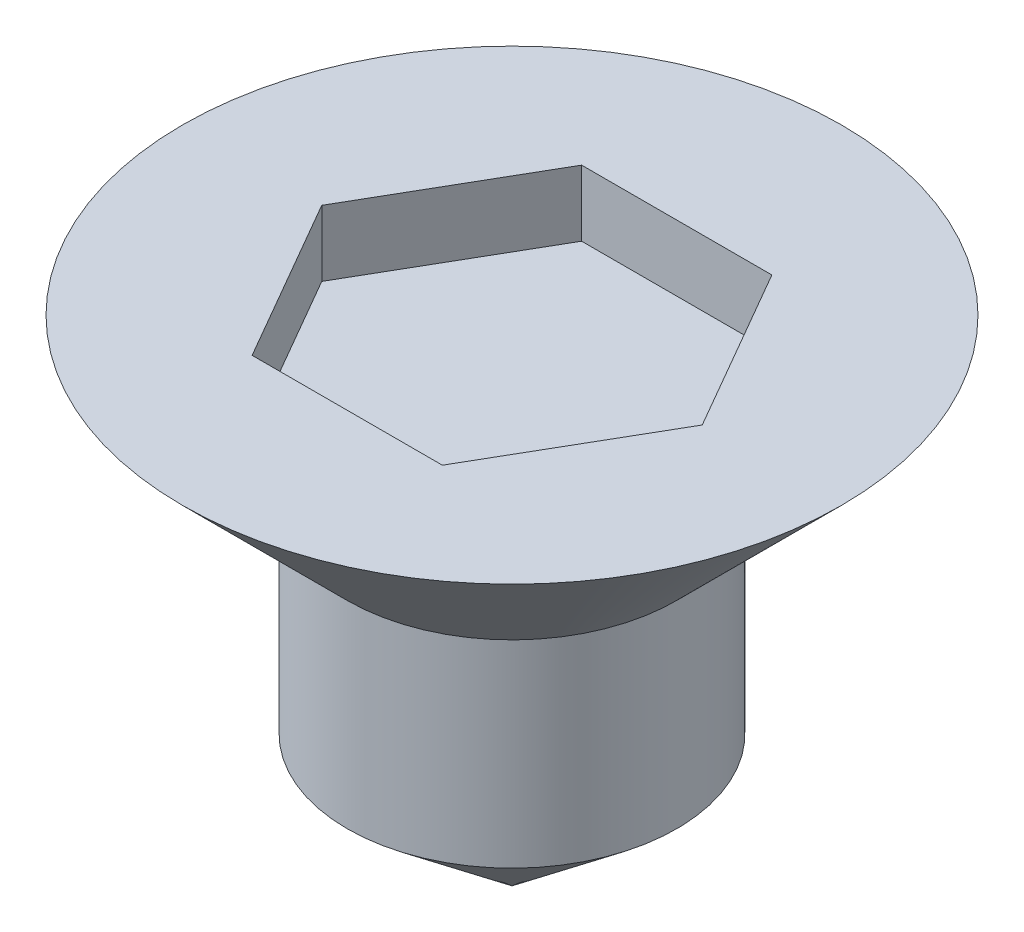
ISO-10303-21;
HEADER;
FILE_DESCRIPTION(('STEP AP214'),'2;1');
FILE_NAME('part.step','',(''),(''),'','','');
FILE_SCHEMA(('AUTOMOTIVE_DESIGN { 1 0 10303 214 1 1 1 1 }'));
ENDSEC;
DATA;
#1=APPLICATION_CONTEXT('core data for automotive mechanical design processes');
#2=APPLICATION_PROTOCOL_DEFINITION('international standard','automotive_design',2000,#1);
#3=PRODUCT_CONTEXT('',#1,'mechanical');
#4=PRODUCT('Part','Part','',(#3));
#5=PRODUCT_RELATED_PRODUCT_CATEGORY('part','',(#4));
#6=PRODUCT_DEFINITION_FORMATION('','',#4);
#7=PRODUCT_DEFINITION_CONTEXT('part definition',#1,'design');
#8=PRODUCT_DEFINITION('design','',#6,#7);
#9=PRODUCT_DEFINITION_SHAPE('','',#8);
#10=(LENGTH_UNIT() NAMED_UNIT(*) SI_UNIT(.MILLI.,.METRE.));
#11=(NAMED_UNIT(*) PLANE_ANGLE_UNIT() SI_UNIT($,.RADIAN.));
#12=(NAMED_UNIT(*) SI_UNIT($,.STERADIAN.) SOLID_ANGLE_UNIT());
#13=UNCERTAINTY_MEASURE_WITH_UNIT(LENGTH_MEASURE(1.E-05),#10,'distance_accuracy_value','');
#14=(GEOMETRIC_REPRESENTATION_CONTEXT(3) GLOBAL_UNCERTAINTY_ASSIGNED_CONTEXT((#13)) GLOBAL_UNIT_ASSIGNED_CONTEXT((#10,
#11,#12)) REPRESENTATION_CONTEXT('',''));
#15=CARTESIAN_POINT('',(0.,0.,0.));
#16=DIRECTION('',(0.,0.,1.));
#17=DIRECTION('',(1.,0.,0.));
#18=AXIS2_PLACEMENT_3D('',#15,#16,#17);
#19=CARTESIAN_POINT('',(0.,1.5,0.));
#20=DIRECTION('',(0.,-1.,0.));
#21=DIRECTION('',(0.,0.,-1.));
#22=AXIS2_PLACEMENT_3D('',#19,#20,#21);
#23=CYLINDRICAL_SURFACE('',#22,1.25);
#24=CARTESIAN_POINT('',(0.,1.5,0.));
#25=DIRECTION('',(0.,1.,0.));
#26=DIRECTION('',(0.,0.,1.));
#27=AXIS2_PLACEMENT_3D('',#24,#25,#26);
#28=CIRCLE('',#27,1.25);
#29=CARTESIAN_POINT('',(0.,1.5,1.25));
#30=VERTEX_POINT('',#29);
#31=EDGE_CURVE('E11',#30,#30,#28,.T.);
#32=ORIENTED_EDGE('',*,*,#31,.F.);
#33=EDGE_LOOP('',(#32));
#34=FACE_BOUND('',#33,.T.);
#35=CARTESIAN_POINT('',(0.,0.,0.));
#36=DIRECTION('',(0.,1.,0.));
#37=DIRECTION('',(0.,0.,1.));
#38=AXIS2_PLACEMENT_3D('',#35,#36,#37);
#39=CIRCLE('',#38,1.25);
#40=CARTESIAN_POINT('',(0.,0.,1.25));
#41=VERTEX_POINT('',#40);
#42=EDGE_CURVE('E145',#41,#41,#39,.T.);
#43=ORIENTED_EDGE('',*,*,#42,.T.);
#44=EDGE_LOOP('',(#43));
#45=FACE_BOUND('',#44,.T.);
#46=ADVANCED_FACE('F47',(#34,#45),#23,.T.);
#47=CARTESIAN_POINT('',(0.,2.75,0.));
#48=DIRECTION('',(0.,-1.,0.));
#49=DIRECTION('',(0.,0.,-1.));
#50=AXIS2_PLACEMENT_3D('',#47,#48,#49);
#51=PLANE('',#50);
#52=DIRECTION('',(-0.5,0.,-0.866025403784439));
#53=VECTOR('',#52,1.);
#54=CARTESIAN_POINT('',(1.44337567297406,2.75,0.));
#55=LINE('',#54,#53);
#56=CARTESIAN_POINT('',(1.44337567297406,2.75,0.));
#57=VERTEX_POINT('',#56);
#58=CARTESIAN_POINT('',(0.721687836487032,2.75,-1.25));
#59=VERTEX_POINT('',#58);
#60=EDGE_CURVE('E144',#57,#59,#55,.T.);
#61=ORIENTED_EDGE('',*,*,#60,.F.);
#62=DIRECTION('',(0.5,0.,-0.866025403784439));
#63=VECTOR('',#62,1.);
#64=CARTESIAN_POINT('',(0.721687836487032,2.75,1.25));
#65=LINE('',#64,#63);
#66=CARTESIAN_POINT('',(0.721687836487032,2.75,1.25));
#67=VERTEX_POINT('',#66);
#68=EDGE_CURVE('E62',#67,#57,#65,.T.);
#69=ORIENTED_EDGE('',*,*,#68,.F.);
#70=DIRECTION('',(1.,0.,0.));
#71=VECTOR('',#70,1.);
#72=CARTESIAN_POINT('',(-0.721687836487033,2.75,1.25));
#73=LINE('',#72,#71);
#74=CARTESIAN_POINT('',(-0.721687836487033,2.75,1.25));
#75=VERTEX_POINT('',#74);
#76=EDGE_CURVE('E158',#75,#67,#73,.T.);
#77=ORIENTED_EDGE('',*,*,#76,.F.);
#78=DIRECTION('',(0.5,0.,0.866025403784439));
#79=VECTOR('',#78,1.);
#80=CARTESIAN_POINT('',(-1.44337567297407,2.75,0.));
#81=LINE('',#80,#79);
#82=CARTESIAN_POINT('',(-1.44337567297407,2.75,0.));
#83=VERTEX_POINT('',#82);
#84=EDGE_CURVE('E155',#83,#75,#81,.T.);
#85=ORIENTED_EDGE('',*,*,#84,.F.);
#86=DIRECTION('',(-0.5,0.,0.866025403784439));
#87=VECTOR('',#86,1.);
#88=CARTESIAN_POINT('',(-0.721687836487032,2.75,-1.25));
#89=LINE('',#88,#87);
#90=CARTESIAN_POINT('',(-0.721687836487032,2.75,-1.25));
#91=VERTEX_POINT('',#90);
#92=EDGE_CURVE('E112',#91,#83,#89,.T.);
#93=ORIENTED_EDGE('',*,*,#92,.F.);
#94=DIRECTION('',(-1.,0.,0.));
#95=VECTOR('',#94,1.);
#96=CARTESIAN_POINT('',(0.721687836487032,2.75,-1.25));
#97=LINE('',#96,#95);
#98=EDGE_CURVE('E149',#59,#91,#97,.T.);
#99=ORIENTED_EDGE('',*,*,#98,.F.);
#100=EDGE_LOOP('',(#61,#69,#77,#85,#93,#99));
#101=FACE_BOUND('',#100,.T.);
#102=CARTESIAN_POINT('',(0.,2.75,0.));
#103=DIRECTION('',(0.,1.,0.));
#104=DIRECTION('',(0.,0.,1.));
#105=AXIS2_PLACEMENT_3D('',#102,#103,#104);
#106=CIRCLE('',#105,2.5);
#107=CARTESIAN_POINT('',(0.,2.75,2.5));
#108=VERTEX_POINT('',#107);
#109=EDGE_CURVE('E55',#108,#108,#106,.T.);
#110=ORIENTED_EDGE('',*,*,#109,.T.);
#111=EDGE_LOOP('',(#110));
#112=FACE_BOUND('',#111,.T.);
#113=ADVANCED_FACE('F176',(#101,#112),#51,.F.);
#114=CARTESIAN_POINT('',(0.,1.5,0.));
#115=DIRECTION('',(0.,1.,0.));
#116=DIRECTION('',(0.,0.,1.));
#117=AXIS2_PLACEMENT_3D('',#114,#115,#116);
#118=CONICAL_SURFACE('',#117,1.25,0.785398163397447);
#119=ORIENTED_EDGE('',*,*,#109,.F.);
#120=EDGE_LOOP('',(#119));
#121=FACE_BOUND('',#120,.T.);
#122=ORIENTED_EDGE('',*,*,#31,.T.);
#123=EDGE_LOOP('',(#122));
#124=FACE_BOUND('',#123,.T.);
#125=ADVANCED_FACE('F178',(#121,#124),#118,.T.);
#126=CARTESIAN_POINT('',(0.721687836487032,2.25,1.25));
#127=DIRECTION('',(0.866025403784439,0.,0.5));
#128=DIRECTION('',(0.5,0.,-0.866025403784439));
#129=AXIS2_PLACEMENT_3D('',#126,#127,#128);
#130=PLANE('',#129);
#131=ORIENTED_EDGE('',*,*,#68,.T.);
#132=DIRECTION('',(0.,1.,0.));
#133=VECTOR('',#132,1.);
#134=CARTESIAN_POINT('',(1.44337567297406,2.25,0.));
#135=LINE('',#134,#133);
#136=CARTESIAN_POINT('',(1.44337567297406,2.25,0.));
#137=VERTEX_POINT('',#136);
#138=EDGE_CURVE('E93',#137,#57,#135,.T.);
#139=ORIENTED_EDGE('',*,*,#138,.F.);
#140=DIRECTION('',(0.5,0.,-0.866025403784439));
#141=VECTOR('',#140,1.);
#142=CARTESIAN_POINT('',(0.721687836487032,2.25,1.25));
#143=LINE('',#142,#141);
#144=CARTESIAN_POINT('',(0.721687836487032,2.25,1.25));
#145=VERTEX_POINT('',#144);
#146=EDGE_CURVE('E161',#145,#137,#143,.T.);
#147=ORIENTED_EDGE('',*,*,#146,.F.);
#148=DIRECTION('',(0.,1.,0.));
#149=VECTOR('',#148,1.);
#150=CARTESIAN_POINT('',(0.721687836487032,2.25,1.25));
#151=LINE('',#150,#149);
#152=EDGE_CURVE('E70',#145,#67,#151,.T.);
#153=ORIENTED_EDGE('',*,*,#152,.T.);
#154=EDGE_LOOP('',(#131,#139,#147,#153));
#155=FACE_BOUND('',#154,.T.);
#156=ADVANCED_FACE('F181',(#155),#130,.F.);
#157=CARTESIAN_POINT('',(-0.721687836487033,2.25,1.25));
#158=DIRECTION('',(0.,0.,1.));
#159=DIRECTION('',(1.,0.,0.));
#160=AXIS2_PLACEMENT_3D('',#157,#158,#159);
#161=PLANE('',#160);
#162=ORIENTED_EDGE('',*,*,#76,.T.);
#163=ORIENTED_EDGE('',*,*,#152,.F.);
#164=DIRECTION('',(1.,0.,0.));
#165=VECTOR('',#164,1.);
#166=CARTESIAN_POINT('',(-0.721687836487033,2.25,1.25));
#167=LINE('',#166,#165);
#168=CARTESIAN_POINT('',(-0.721687836487033,2.25,1.25));
#169=VERTEX_POINT('',#168);
#170=EDGE_CURVE('E126',#169,#145,#167,.T.);
#171=ORIENTED_EDGE('',*,*,#170,.F.);
#172=DIRECTION('',(0.,1.,0.));
#173=VECTOR('',#172,1.);
#174=CARTESIAN_POINT('',(-0.721687836487033,2.25,1.25));
#175=LINE('',#174,#173);
#176=EDGE_CURVE('E117',#169,#75,#175,.T.);
#177=ORIENTED_EDGE('',*,*,#176,.T.);
#178=EDGE_LOOP('',(#162,#163,#171,#177));
#179=FACE_BOUND('',#178,.T.);
#180=ADVANCED_FACE('F203',(#179),#161,.F.);
#181=CARTESIAN_POINT('',(-1.44337567297407,2.25,0.));
#182=DIRECTION('',(-0.866025403784439,0.,0.5));
#183=DIRECTION('',(0.5,0.,0.866025403784439));
#184=AXIS2_PLACEMENT_3D('',#181,#182,#183);
#185=PLANE('',#184);
#186=ORIENTED_EDGE('',*,*,#84,.T.);
#187=ORIENTED_EDGE('',*,*,#176,.F.);
#188=DIRECTION('',(0.5,0.,0.866025403784439));
#189=VECTOR('',#188,1.);
#190=CARTESIAN_POINT('',(-1.44337567297407,2.25,0.));
#191=LINE('',#190,#189);
#192=CARTESIAN_POINT('',(-1.44337567297407,2.25,0.));
#193=VERTEX_POINT('',#192);
#194=EDGE_CURVE('E121',#193,#169,#191,.T.);
#195=ORIENTED_EDGE('',*,*,#194,.F.);
#196=DIRECTION('',(0.,1.,0.));
#197=VECTOR('',#196,1.);
#198=CARTESIAN_POINT('',(-1.44337567297407,2.25,0.));
#199=LINE('',#198,#197);
#200=EDGE_CURVE('E105',#193,#83,#199,.T.);
#201=ORIENTED_EDGE('',*,*,#200,.T.);
#202=EDGE_LOOP('',(#186,#187,#195,#201));
#203=FACE_BOUND('',#202,.T.);
#204=ADVANCED_FACE('F122',(#203),#185,.F.);
#205=CARTESIAN_POINT('',(-0.721687836487032,2.25,-1.25));
#206=DIRECTION('',(-0.866025403784438,0.,-0.5));
#207=DIRECTION('',(-0.5,0.,0.866025403784439));
#208=AXIS2_PLACEMENT_3D('',#205,#206,#207);
#209=PLANE('',#208);
#210=ORIENTED_EDGE('',*,*,#92,.T.);
#211=ORIENTED_EDGE('',*,*,#200,.F.);
#212=DIRECTION('',(-0.5,0.,0.866025403784439));
#213=VECTOR('',#212,1.);
#214=CARTESIAN_POINT('',(-0.721687836487032,2.25,-1.25));
#215=LINE('',#214,#213);
#216=CARTESIAN_POINT('',(-0.721687836487032,2.25,-1.25));
#217=VERTEX_POINT('',#216);
#218=EDGE_CURVE('E109',#217,#193,#215,.T.);
#219=ORIENTED_EDGE('',*,*,#218,.F.);
#220=DIRECTION('',(0.,1.,0.));
#221=VECTOR('',#220,1.);
#222=CARTESIAN_POINT('',(-0.721687836487032,2.25,-1.25));
#223=LINE('',#222,#221);
#224=EDGE_CURVE('E118',#217,#91,#223,.T.);
#225=ORIENTED_EDGE('',*,*,#224,.T.);
#226=EDGE_LOOP('',(#210,#211,#219,#225));
#227=FACE_BOUND('',#226,.T.);
#228=ADVANCED_FACE('F107',(#227),#209,.F.);
#229=CARTESIAN_POINT('',(0.721687836487032,2.25,-1.25));
#230=DIRECTION('',(0.,0.,-1.));
#231=DIRECTION('',(-1.,0.,0.));
#232=AXIS2_PLACEMENT_3D('',#229,#230,#231);
#233=PLANE('',#232);
#234=ORIENTED_EDGE('',*,*,#98,.T.);
#235=ORIENTED_EDGE('',*,*,#224,.F.);
#236=DIRECTION('',(-1.,0.,0.));
#237=VECTOR('',#236,1.);
#238=CARTESIAN_POINT('',(0.721687836487032,2.25,-1.25));
#239=LINE('',#238,#237);
#240=CARTESIAN_POINT('',(0.721687836487032,2.25,-1.25));
#241=VERTEX_POINT('',#240);
#242=EDGE_CURVE('E132',#241,#217,#239,.T.);
#243=ORIENTED_EDGE('',*,*,#242,.F.);
#244=DIRECTION('',(0.,1.,0.));
#245=VECTOR('',#244,1.);
#246=CARTESIAN_POINT('',(0.721687836487032,2.25,-1.25));
#247=LINE('',#246,#245);
#248=EDGE_CURVE('E168',#241,#59,#247,.T.);
#249=ORIENTED_EDGE('',*,*,#248,.T.);
#250=EDGE_LOOP('',(#234,#235,#243,#249));
#251=FACE_BOUND('',#250,.T.);
#252=ADVANCED_FACE('F200',(#251),#233,.F.);
#253=CARTESIAN_POINT('',(1.44337567297406,2.25,0.));
#254=DIRECTION('',(0.866025403784439,0.,-0.5));
#255=DIRECTION('',(-0.5,0.,-0.866025403784439));
#256=AXIS2_PLACEMENT_3D('',#253,#254,#255);
#257=PLANE('',#256);
#258=ORIENTED_EDGE('',*,*,#60,.T.);
#259=ORIENTED_EDGE('',*,*,#248,.F.);
#260=DIRECTION('',(-0.5,0.,-0.866025403784439));
#261=VECTOR('',#260,1.);
#262=CARTESIAN_POINT('',(1.44337567297406,2.25,0.));
#263=LINE('',#262,#261);
#264=EDGE_CURVE('E136',#137,#241,#263,.T.);
#265=ORIENTED_EDGE('',*,*,#264,.F.);
#266=ORIENTED_EDGE('',*,*,#138,.T.);
#267=EDGE_LOOP('',(#258,#259,#265,#266));
#268=FACE_BOUND('',#267,.T.);
#269=ADVANCED_FACE('F196',(#268),#257,.F.);
#270=CARTESIAN_POINT('',(0.,2.25,0.));
#271=DIRECTION('',(0.,1.,0.));
#272=DIRECTION('',(0.,0.,1.));
#273=AXIS2_PLACEMENT_3D('',#270,#271,#272);
#274=PLANE('',#273);
#275=ORIENTED_EDGE('',*,*,#146,.T.);
#276=ORIENTED_EDGE('',*,*,#264,.T.);
#277=ORIENTED_EDGE('',*,*,#242,.T.);
#278=ORIENTED_EDGE('',*,*,#218,.T.);
#279=ORIENTED_EDGE('',*,*,#194,.T.);
#280=ORIENTED_EDGE('',*,*,#170,.T.);
#281=EDGE_LOOP('',(#275,#276,#277,#278,#279,#280));
#282=FACE_BOUND('',#281,.T.);
#283=ADVANCED_FACE('F129',(#282),#274,.T.);
#284=CARTESIAN_POINT('',(0.,0.,0.));
#285=DIRECTION('',(0.,1.,0.));
#286=DIRECTION('',(0.,0.,1.));
#287=AXIS2_PLACEMENT_3D('',#284,#285,#286);
#288=CONICAL_SURFACE('',#287,1.25,0.896055384571344);
#289=CARTESIAN_POINT('',(0.,-1.,0.));
#290=VERTEX_POINT('',#289);
#291=VERTEX_LOOP('',#290);
#292=FACE_BOUND('',#291,.T.);
#293=ORIENTED_EDGE('',*,*,#42,.F.);
#294=EDGE_LOOP('',(#293));
#295=FACE_BOUND('',#294,.T.);
#296=ADVANCED_FACE('F272',(#292,#295),#288,.T.);
#297=CLOSED_SHELL('',(#46,#113,#125,#156,#180,#204,#228,#252,#269,#283,#296));
#298=MANIFOLD_SOLID_BREP('B2',#297);
#299=ADVANCED_BREP_SHAPE_REPRESENTATION('',(#18,#298),#14);
#300=SHAPE_DEFINITION_REPRESENTATION(#9,#299);
ENDSEC;
END-ISO-10303-21;
